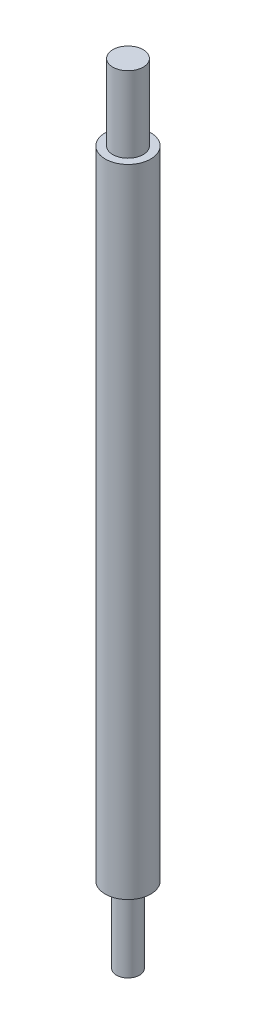
ISO-10303-21;
HEADER;
FILE_DESCRIPTION(('STEP AP214'),'2;1');
FILE_NAME('part.step','',(''),(''),'','','');
FILE_SCHEMA(('AUTOMOTIVE_DESIGN { 1 0 10303 214 1 1 1 1 }'));
ENDSEC;
DATA;
#1=APPLICATION_CONTEXT('core data for automotive mechanical design processes');
#2=APPLICATION_PROTOCOL_DEFINITION('international standard','automotive_design',2000,#1);
#3=PRODUCT_CONTEXT('',#1,'mechanical');
#4=PRODUCT('Part','Part','',(#3));
#5=PRODUCT_RELATED_PRODUCT_CATEGORY('part','',(#4));
#6=PRODUCT_DEFINITION_FORMATION('','',#4);
#7=PRODUCT_DEFINITION_CONTEXT('part definition',#1,'design');
#8=PRODUCT_DEFINITION('design','',#6,#7);
#9=PRODUCT_DEFINITION_SHAPE('','',#8);
#10=(LENGTH_UNIT() NAMED_UNIT(*) SI_UNIT(.MILLI.,.METRE.));
#11=(NAMED_UNIT(*) PLANE_ANGLE_UNIT() SI_UNIT($,.RADIAN.));
#12=(NAMED_UNIT(*) SI_UNIT($,.STERADIAN.) SOLID_ANGLE_UNIT());
#13=UNCERTAINTY_MEASURE_WITH_UNIT(LENGTH_MEASURE(1.E-05),#10,'distance_accuracy_value','');
#14=(GEOMETRIC_REPRESENTATION_CONTEXT(3) GLOBAL_UNCERTAINTY_ASSIGNED_CONTEXT((#13)) GLOBAL_UNIT_ASSIGNED_CONTEXT((#10,
#11,#12)) REPRESENTATION_CONTEXT('',''));
#15=CARTESIAN_POINT('',(0.,0.,0.));
#16=DIRECTION('',(0.,0.,1.));
#17=DIRECTION('',(1.,0.,0.));
#18=AXIS2_PLACEMENT_3D('',#15,#16,#17);
#19=CARTESIAN_POINT('',(0.,84.,0.));
#20=DIRECTION('',(0.,-1.,0.));
#21=DIRECTION('',(0.,0.,-1.));
#22=AXIS2_PLACEMENT_3D('',#19,#20,#21);
#23=CYLINDRICAL_SURFACE('',#22,3.);
#24=CARTESIAN_POINT('',(0.,84.,0.));
#25=DIRECTION('',(0.,1.,0.));
#26=DIRECTION('',(0.,0.,1.));
#27=AXIS2_PLACEMENT_3D('',#24,#25,#26);
#28=CIRCLE('',#27,3.);
#29=CARTESIAN_POINT('',(0.,84.,3.));
#30=VERTEX_POINT('',#29);
#31=EDGE_CURVE('E42',#30,#30,#28,.T.);
#32=ORIENTED_EDGE('',*,*,#31,.F.);
#33=EDGE_LOOP('',(#32));
#34=FACE_BOUND('',#33,.T.);
#35=CARTESIAN_POINT('',(0.,0.,0.));
#36=DIRECTION('',(0.,1.,0.));
#37=DIRECTION('',(0.,0.,1.));
#38=AXIS2_PLACEMENT_3D('',#35,#36,#37);
#39=CIRCLE('',#38,3.);
#40=CARTESIAN_POINT('',(0.,0.,3.));
#41=VERTEX_POINT('',#40);
#42=EDGE_CURVE('E33',#41,#41,#39,.T.);
#43=ORIENTED_EDGE('',*,*,#42,.T.);
#44=EDGE_LOOP('',(#43));
#45=FACE_BOUND('',#44,.T.);
#46=ADVANCED_FACE('F30',(#34,#45),#23,.T.);
#47=CARTESIAN_POINT('',(0.,84.,0.));
#48=DIRECTION('',(0.,1.,0.));
#49=DIRECTION('',(0.,0.,1.));
#50=AXIS2_PLACEMENT_3D('',#47,#48,#49);
#51=PLANE('',#50);
#52=CARTESIAN_POINT('',(0.,84.,0.));
#53=DIRECTION('',(0.,1.,0.));
#54=DIRECTION('',(0.,0.,1.));
#55=AXIS2_PLACEMENT_3D('',#52,#53,#54);
#56=CIRCLE('',#55,2.);
#57=CARTESIAN_POINT('',(0.,84.,2.));
#58=VERTEX_POINT('',#57);
#59=EDGE_CURVE('E37',#58,#58,#56,.T.);
#60=ORIENTED_EDGE('',*,*,#59,.F.);
#61=EDGE_LOOP('',(#60));
#62=FACE_BOUND('',#61,.T.);
#63=ORIENTED_EDGE('',*,*,#31,.T.);
#64=EDGE_LOOP('',(#63));
#65=FACE_BOUND('',#64,.T.);
#66=ADVANCED_FACE('F59',(#62,#65),#51,.T.);
#67=CARTESIAN_POINT('',(0.,0.,0.));
#68=DIRECTION('',(0.,1.,0.));
#69=DIRECTION('',(0.,0.,1.));
#70=AXIS2_PLACEMENT_3D('',#67,#68,#69);
#71=PLANE('',#70);
#72=CARTESIAN_POINT('',(0.,0.,0.));
#73=DIRECTION('',(0.,-1.,0.));
#74=DIRECTION('',(0.,0.,-1.));
#75=AXIS2_PLACEMENT_3D('',#72,#73,#74);
#76=CIRCLE('',#75,1.5260305884623);
#77=CARTESIAN_POINT('',(0.,0.,-1.5260305884623));
#78=VERTEX_POINT('',#77);
#79=EDGE_CURVE('E10',#78,#78,#76,.T.);
#80=ORIENTED_EDGE('',*,*,#79,.F.);
#81=EDGE_LOOP('',(#80));
#82=FACE_BOUND('',#81,.T.);
#83=ORIENTED_EDGE('',*,*,#42,.F.);
#84=EDGE_LOOP('',(#83));
#85=FACE_BOUND('',#84,.T.);
#86=ADVANCED_FACE('F56',(#82,#85),#71,.F.);
#87=CARTESIAN_POINT('',(0.,94.,0.));
#88=DIRECTION('',(0.,-1.,0.));
#89=DIRECTION('',(0.,0.,-1.));
#90=AXIS2_PLACEMENT_3D('',#87,#88,#89);
#91=CYLINDRICAL_SURFACE('',#90,2.);
#92=CARTESIAN_POINT('',(0.,94.,0.));
#93=DIRECTION('',(0.,1.,0.));
#94=DIRECTION('',(0.,0.,1.));
#95=AXIS2_PLACEMENT_3D('',#92,#93,#94);
#96=CIRCLE('',#95,2.);
#97=CARTESIAN_POINT('',(0.,94.,2.));
#98=VERTEX_POINT('',#97);
#99=EDGE_CURVE('E47',#98,#98,#96,.T.);
#100=ORIENTED_EDGE('',*,*,#99,.F.);
#101=EDGE_LOOP('',(#100));
#102=FACE_BOUND('',#101,.T.);
#103=ORIENTED_EDGE('',*,*,#59,.T.);
#104=EDGE_LOOP('',(#103));
#105=FACE_BOUND('',#104,.T.);
#106=ADVANCED_FACE('F58',(#102,#105),#91,.T.);
#107=CARTESIAN_POINT('',(0.,94.,0.));
#108=DIRECTION('',(0.,1.,0.));
#109=DIRECTION('',(0.,0.,1.));
#110=AXIS2_PLACEMENT_3D('',#107,#108,#109);
#111=PLANE('',#110);
#112=ORIENTED_EDGE('',*,*,#99,.T.);
#113=EDGE_LOOP('',(#112));
#114=FACE_BOUND('',#113,.T.);
#115=ADVANCED_FACE('F65',(#114),#111,.T.);
#116=CARTESIAN_POINT('',(0.,-10.,0.));
#117=DIRECTION('',(0.,1.,0.));
#118=DIRECTION('',(0.,0.,1.));
#119=AXIS2_PLACEMENT_3D('',#116,#117,#118);
#120=CYLINDRICAL_SURFACE('',#119,1.5260305884623);
#121=CARTESIAN_POINT('',(0.,-10.,0.));
#122=DIRECTION('',(0.,-1.,0.));
#123=DIRECTION('',(0.,0.,-1.));
#124=AXIS2_PLACEMENT_3D('',#121,#122,#123);
#125=CIRCLE('',#124,1.5260305884623);
#126=CARTESIAN_POINT('',(0.,-10.,-1.5260305884623));
#127=VERTEX_POINT('',#126);
#128=EDGE_CURVE('E46',#127,#127,#125,.T.);
#129=ORIENTED_EDGE('',*,*,#128,.F.);
#130=EDGE_LOOP('',(#129));
#131=FACE_BOUND('',#130,.T.);
#132=ORIENTED_EDGE('',*,*,#79,.T.);
#133=EDGE_LOOP('',(#132));
#134=FACE_BOUND('',#133,.T.);
#135=ADVANCED_FACE('F93',(#131,#134),#120,.T.);
#136=CARTESIAN_POINT('',(0.,-10.,0.));
#137=DIRECTION('',(0.,-1.,0.));
#138=DIRECTION('',(0.,0.,-1.));
#139=AXIS2_PLACEMENT_3D('',#136,#137,#138);
#140=PLANE('',#139);
#141=ORIENTED_EDGE('',*,*,#128,.T.);
#142=EDGE_LOOP('',(#141));
#143=FACE_BOUND('',#142,.T.);
#144=ADVANCED_FACE('F107',(#143),#140,.T.);
#145=CLOSED_SHELL('',(#46,#66,#86,#106,#115,#135,#144));
#146=MANIFOLD_SOLID_BREP('B2',#145);
#147=ADVANCED_BREP_SHAPE_REPRESENTATION('',(#18,#146),#14);
#148=SHAPE_DEFINITION_REPRESENTATION(#9,#147);
ENDSEC;
END-ISO-10303-21;
